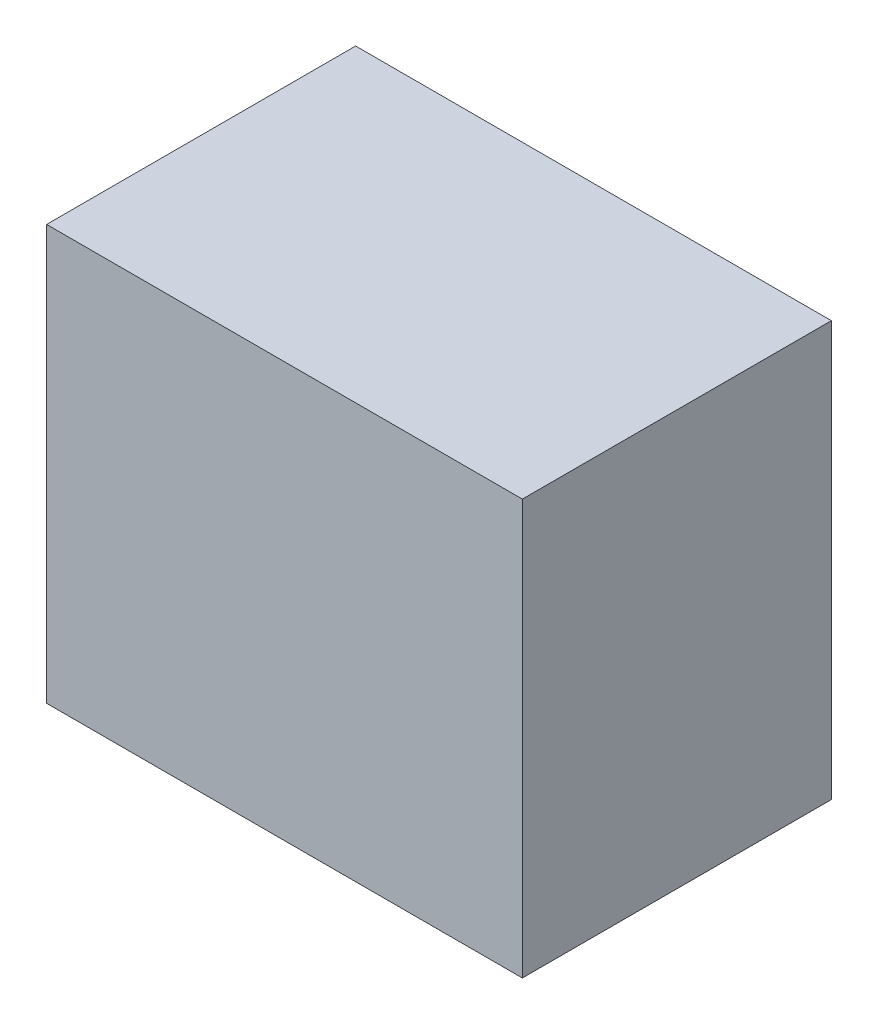
ISO-10303-21;
HEADER;
FILE_DESCRIPTION(('STEP AP214'),'2;1');
FILE_NAME('part.step','',(''),(''),'','','');
FILE_SCHEMA(('AUTOMOTIVE_DESIGN { 1 0 10303 214 1 1 1 1 }'));
ENDSEC;
DATA;
#1=APPLICATION_CONTEXT('core data for automotive mechanical design processes');
#2=APPLICATION_PROTOCOL_DEFINITION('international standard','automotive_design',2000,#1);
#3=PRODUCT_CONTEXT('',#1,'mechanical');
#4=PRODUCT('Part','Part','',(#3));
#5=PRODUCT_RELATED_PRODUCT_CATEGORY('part','',(#4));
#6=PRODUCT_DEFINITION_FORMATION('','',#4);
#7=PRODUCT_DEFINITION_CONTEXT('part definition',#1,'design');
#8=PRODUCT_DEFINITION('design','',#6,#7);
#9=PRODUCT_DEFINITION_SHAPE('','',#8);
#10=(LENGTH_UNIT() NAMED_UNIT(*) SI_UNIT(.MILLI.,.METRE.));
#11=(NAMED_UNIT(*) PLANE_ANGLE_UNIT() SI_UNIT($,.RADIAN.));
#12=(NAMED_UNIT(*) SI_UNIT($,.STERADIAN.) SOLID_ANGLE_UNIT());
#13=UNCERTAINTY_MEASURE_WITH_UNIT(LENGTH_MEASURE(1.E-05),#10,'distance_accuracy_value','');
#14=(GEOMETRIC_REPRESENTATION_CONTEXT(3) GLOBAL_UNCERTAINTY_ASSIGNED_CONTEXT((#13)) GLOBAL_UNIT_ASSIGNED_CONTEXT((#10,
#11,#12)) REPRESENTATION_CONTEXT('',''));
#15=CARTESIAN_POINT('',(0.,0.,0.));
#16=DIRECTION('',(0.,0.,1.));
#17=DIRECTION('',(1.,0.,0.));
#18=AXIS2_PLACEMENT_3D('',#15,#16,#17);
#19=CARTESIAN_POINT('',(0.,10.2,0.));
#20=DIRECTION('',(1.,0.,0.));
#21=DIRECTION('',(0.,0.,-1.));
#22=AXIS2_PLACEMENT_3D('',#19,#20,#21);
#23=PLANE('',#22);
#24=DIRECTION('',(0.,0.,1.));
#25=VECTOR('',#24,1.);
#26=CARTESIAN_POINT('',(0.,0.,0.));
#27=LINE('',#26,#25);
#28=CARTESIAN_POINT('',(0.,0.,-7.6));
#29=VERTEX_POINT('',#28);
#30=CARTESIAN_POINT('',(0.,0.,0.));
#31=VERTEX_POINT('',#30);
#32=EDGE_CURVE('E98',#29,#31,#27,.T.);
#33=ORIENTED_EDGE('',*,*,#32,.T.);
#34=DIRECTION('',(0.,-1.,0.));
#35=VECTOR('',#34,1.);
#36=CARTESIAN_POINT('',(0.,10.2,0.));
#37=LINE('',#36,#35);
#38=CARTESIAN_POINT('',(0.,10.2,0.));
#39=VERTEX_POINT('',#38);
#40=EDGE_CURVE('E11',#39,#31,#37,.T.);
#41=ORIENTED_EDGE('',*,*,#40,.F.);
#42=DIRECTION('',(0.,0.,1.));
#43=VECTOR('',#42,1.);
#44=CARTESIAN_POINT('',(0.,10.2,0.));
#45=LINE('',#44,#43);
#46=CARTESIAN_POINT('',(0.,10.2,-7.6));
#47=VERTEX_POINT('',#46);
#48=EDGE_CURVE('E86',#47,#39,#45,.T.);
#49=ORIENTED_EDGE('',*,*,#48,.F.);
#50=DIRECTION('',(0.,-1.,0.));
#51=VECTOR('',#50,1.);
#52=CARTESIAN_POINT('',(0.,10.2,-7.6));
#53=LINE('',#52,#51);
#54=EDGE_CURVE('E94',#47,#29,#53,.T.);
#55=ORIENTED_EDGE('',*,*,#54,.T.);
#56=EDGE_LOOP('',(#33,#41,#49,#55));
#57=FACE_BOUND('',#56,.T.);
#58=ADVANCED_FACE('F35',(#57),#23,.F.);
#59=CARTESIAN_POINT('',(0.,10.2,0.));
#60=DIRECTION('',(0.,0.,-1.));
#61=DIRECTION('',(-1.,0.,0.));
#62=AXIS2_PLACEMENT_3D('',#59,#60,#61);
#63=PLANE('',#62);
#64=DIRECTION('',(1.,0.,0.));
#65=VECTOR('',#64,1.);
#66=CARTESIAN_POINT('',(0.,0.,0.));
#67=LINE('',#66,#65);
#68=CARTESIAN_POINT('',(11.7,0.,0.));
#69=VERTEX_POINT('',#68);
#70=EDGE_CURVE('E90',#31,#69,#67,.T.);
#71=ORIENTED_EDGE('',*,*,#70,.T.);
#72=DIRECTION('',(0.,-1.,0.));
#73=VECTOR('',#72,1.);
#74=CARTESIAN_POINT('',(11.7,10.2,0.));
#75=LINE('',#74,#73);
#76=CARTESIAN_POINT('',(11.7,10.2,0.));
#77=VERTEX_POINT('',#76);
#78=EDGE_CURVE('E43',#77,#69,#75,.T.);
#79=ORIENTED_EDGE('',*,*,#78,.F.);
#80=DIRECTION('',(1.,0.,0.));
#81=VECTOR('',#80,1.);
#82=CARTESIAN_POINT('',(0.,10.2,0.));
#83=LINE('',#82,#81);
#84=EDGE_CURVE('E81',#39,#77,#83,.T.);
#85=ORIENTED_EDGE('',*,*,#84,.F.);
#86=ORIENTED_EDGE('',*,*,#40,.T.);
#87=EDGE_LOOP('',(#71,#79,#85,#86));
#88=FACE_BOUND('',#87,.T.);
#89=ADVANCED_FACE('F89',(#88),#63,.F.);
#90=CARTESIAN_POINT('',(11.7,10.2,0.));
#91=DIRECTION('',(-1.,0.,0.));
#92=DIRECTION('',(0.,0.,1.));
#93=AXIS2_PLACEMENT_3D('',#90,#91,#92);
#94=PLANE('',#93);
#95=DIRECTION('',(0.,0.,-1.));
#96=VECTOR('',#95,1.);
#97=CARTESIAN_POINT('',(11.7,0.,0.));
#98=LINE('',#97,#96);
#99=CARTESIAN_POINT('',(11.7,0.,-7.6));
#100=VERTEX_POINT('',#99);
#101=EDGE_CURVE('E68',#69,#100,#98,.T.);
#102=ORIENTED_EDGE('',*,*,#101,.T.);
#103=DIRECTION('',(0.,-1.,0.));
#104=VECTOR('',#103,1.);
#105=CARTESIAN_POINT('',(11.7,10.2,-7.6));
#106=LINE('',#105,#104);
#107=CARTESIAN_POINT('',(11.7,10.2,-7.6));
#108=VERTEX_POINT('',#107);
#109=EDGE_CURVE('E91',#108,#100,#106,.T.);
#110=ORIENTED_EDGE('',*,*,#109,.F.);
#111=DIRECTION('',(0.,0.,-1.));
#112=VECTOR('',#111,1.);
#113=CARTESIAN_POINT('',(11.7,10.2,0.));
#114=LINE('',#113,#112);
#115=EDGE_CURVE('E84',#77,#108,#114,.T.);
#116=ORIENTED_EDGE('',*,*,#115,.F.);
#117=ORIENTED_EDGE('',*,*,#78,.T.);
#118=EDGE_LOOP('',(#102,#110,#116,#117));
#119=FACE_BOUND('',#118,.T.);
#120=ADVANCED_FACE('F92',(#119),#94,.F.);
#121=CARTESIAN_POINT('',(0.,10.2,-7.6));
#122=DIRECTION('',(0.,0.,1.));
#123=DIRECTION('',(1.,0.,0.));
#124=AXIS2_PLACEMENT_3D('',#121,#122,#123);
#125=PLANE('',#124);
#126=DIRECTION('',(-1.,0.,0.));
#127=VECTOR('',#126,1.);
#128=CARTESIAN_POINT('',(0.,0.,-7.6));
#129=LINE('',#128,#127);
#130=EDGE_CURVE('E74',#100,#29,#129,.T.);
#131=ORIENTED_EDGE('',*,*,#130,.T.);
#132=ORIENTED_EDGE('',*,*,#54,.F.);
#133=DIRECTION('',(-1.,0.,0.));
#134=VECTOR('',#133,1.);
#135=CARTESIAN_POINT('',(0.,10.2,-7.6));
#136=LINE('',#135,#134);
#137=EDGE_CURVE('E51',#108,#47,#136,.T.);
#138=ORIENTED_EDGE('',*,*,#137,.F.);
#139=ORIENTED_EDGE('',*,*,#109,.T.);
#140=EDGE_LOOP('',(#131,#132,#138,#139));
#141=FACE_BOUND('',#140,.T.);
#142=ADVANCED_FACE('F105',(#141),#125,.F.);
#143=CARTESIAN_POINT('',(0.,10.2,0.));
#144=DIRECTION('',(0.,-1.,0.));
#145=DIRECTION('',(0.,0.,-1.));
#146=AXIS2_PLACEMENT_3D('',#143,#144,#145);
#147=PLANE('',#146);
#148=ORIENTED_EDGE('',*,*,#48,.T.);
#149=ORIENTED_EDGE('',*,*,#84,.T.);
#150=ORIENTED_EDGE('',*,*,#115,.T.);
#151=ORIENTED_EDGE('',*,*,#137,.T.);
#152=EDGE_LOOP('',(#148,#149,#150,#151));
#153=FACE_BOUND('',#152,.T.);
#154=ADVANCED_FACE('F82',(#153),#147,.F.);
#155=CARTESIAN_POINT('',(0.,0.,0.));
#156=DIRECTION('',(0.,-1.,0.));
#157=DIRECTION('',(0.,0.,-1.));
#158=AXIS2_PLACEMENT_3D('',#155,#156,#157);
#159=PLANE('',#158);
#160=ORIENTED_EDGE('',*,*,#32,.F.);
#161=ORIENTED_EDGE('',*,*,#130,.F.);
#162=ORIENTED_EDGE('',*,*,#101,.F.);
#163=ORIENTED_EDGE('',*,*,#70,.F.);
#164=EDGE_LOOP('',(#160,#161,#162,#163));
#165=FACE_BOUND('',#164,.T.);
#166=ADVANCED_FACE('F108',(#165),#159,.T.);
#167=CLOSED_SHELL('',(#58,#89,#120,#142,#154,#166));
#168=MANIFOLD_SOLID_BREP('B2',#167);
#169=ADVANCED_BREP_SHAPE_REPRESENTATION('',(#18,#168),#14);
#170=SHAPE_DEFINITION_REPRESENTATION(#9,#169);
ENDSEC;
END-ISO-10303-21;
